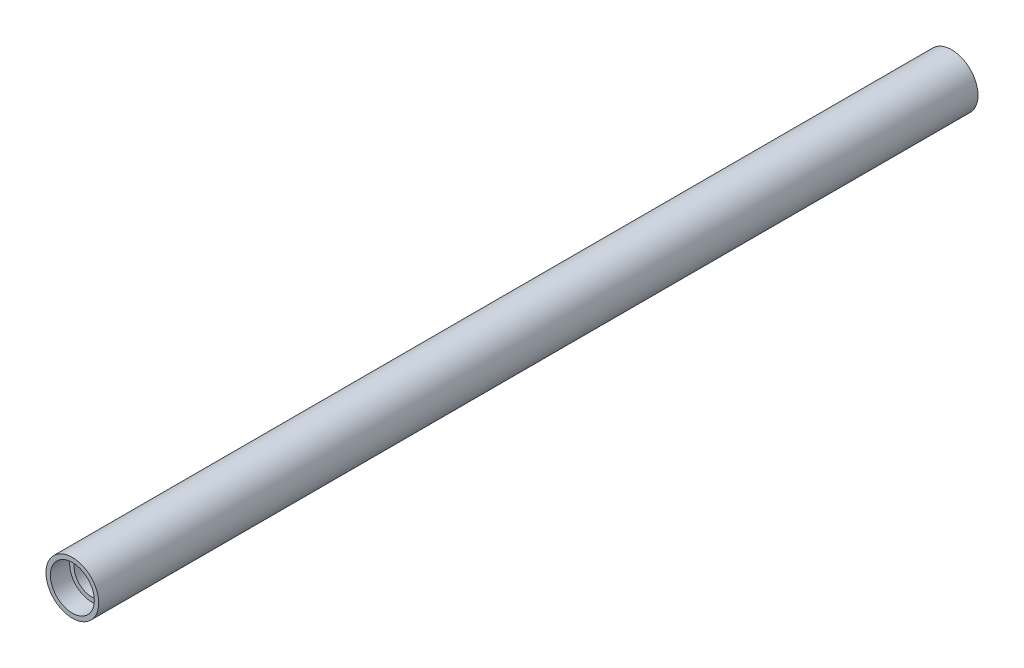
ISO-10303-21;
HEADER;
FILE_DESCRIPTION(('STEP AP214'),'2;1');
FILE_NAME('part.step','',(''),(''),'','','');
FILE_SCHEMA(('AUTOMOTIVE_DESIGN { 1 0 10303 214 1 1 1 1 }'));
ENDSEC;
DATA;
#1=APPLICATION_CONTEXT('core data for automotive mechanical design processes');
#2=APPLICATION_PROTOCOL_DEFINITION('international standard','automotive_design',2000,#1);
#3=PRODUCT_CONTEXT('',#1,'mechanical');
#4=PRODUCT('Part','Part','',(#3));
#5=PRODUCT_RELATED_PRODUCT_CATEGORY('part','',(#4));
#6=PRODUCT_DEFINITION_FORMATION('','',#4);
#7=PRODUCT_DEFINITION_CONTEXT('part definition',#1,'design');
#8=PRODUCT_DEFINITION('design','',#6,#7);
#9=PRODUCT_DEFINITION_SHAPE('','',#8);
#10=(LENGTH_UNIT() NAMED_UNIT(*) SI_UNIT(.MILLI.,.METRE.));
#11=(NAMED_UNIT(*) PLANE_ANGLE_UNIT() SI_UNIT($,.RADIAN.));
#12=(NAMED_UNIT(*) SI_UNIT($,.STERADIAN.) SOLID_ANGLE_UNIT());
#13=UNCERTAINTY_MEASURE_WITH_UNIT(LENGTH_MEASURE(1.E-05),#10,'distance_accuracy_value','');
#14=(GEOMETRIC_REPRESENTATION_CONTEXT(3) GLOBAL_UNCERTAINTY_ASSIGNED_CONTEXT((#13)) GLOBAL_UNIT_ASSIGNED_CONTEXT((#10,
#11,#12)) REPRESENTATION_CONTEXT('',''));
#15=CARTESIAN_POINT('',(0.,0.,0.));
#16=DIRECTION('',(0.,0.,1.));
#17=DIRECTION('',(1.,0.,0.));
#18=AXIS2_PLACEMENT_3D('',#15,#16,#17);
#19=CARTESIAN_POINT('',(0.,0.,125.));
#20=DIRECTION('',(0.,0.,-1.));
#21=DIRECTION('',(-1.,0.,0.));
#22=AXIS2_PLACEMENT_3D('',#19,#20,#21);
#23=CYLINDRICAL_SURFACE('',#22,5.);
#24=CARTESIAN_POINT('',(0.,0.,119.5));
#25=DIRECTION('',(0.,0.,1.));
#26=DIRECTION('',(1.,0.,0.));
#27=AXIS2_PLACEMENT_3D('',#24,#25,#26);
#28=CIRCLE('',#27,5.);
#29=CARTESIAN_POINT('',(5.,0.,119.5));
#30=VERTEX_POINT('',#29);
#31=EDGE_CURVE('E44',#30,#30,#28,.T.);
#32=ORIENTED_EDGE('',*,*,#31,.T.);
#33=EDGE_LOOP('',(#32));
#34=FACE_BOUND('',#33,.T.);
#35=CARTESIAN_POINT('',(0.,0.,-119.5));
#36=DIRECTION('',(0.,0.,-1.));
#37=DIRECTION('',(-1.,0.,0.));
#38=AXIS2_PLACEMENT_3D('',#35,#36,#37);
#39=CIRCLE('',#38,5.);
#40=CARTESIAN_POINT('',(-5.,0.,-119.5));
#41=VERTEX_POINT('',#40);
#42=EDGE_CURVE('E35',#41,#41,#39,.T.);
#43=ORIENTED_EDGE('',*,*,#42,.T.);
#44=EDGE_LOOP('',(#43));
#45=FACE_BOUND('',#44,.T.);
#46=ADVANCED_FACE('F31',(#34,#45),#23,.F.);
#47=CARTESIAN_POINT('',(0.,0.,125.));
#48=DIRECTION('',(0.,0.,1.));
#49=DIRECTION('',(1.,0.,0.));
#50=AXIS2_PLACEMENT_3D('',#47,#48,#49);
#51=PLANE('',#50);
#52=CARTESIAN_POINT('',(0.,0.,125.));
#53=DIRECTION('',(0.,0.,1.));
#54=DIRECTION('',(1.,0.,0.));
#55=AXIS2_PLACEMENT_3D('',#52,#53,#54);
#56=CIRCLE('',#55,6.25);
#57=CARTESIAN_POINT('',(6.25,0.,125.));
#58=VERTEX_POINT('',#57);
#59=EDGE_CURVE('E47',#58,#58,#56,.T.);
#60=ORIENTED_EDGE('',*,*,#59,.F.);
#61=EDGE_LOOP('',(#60));
#62=FACE_BOUND('',#61,.T.);
#63=CARTESIAN_POINT('',(0.,0.,125.));
#64=DIRECTION('',(0.,0.,1.));
#65=DIRECTION('',(1.,0.,0.));
#66=AXIS2_PLACEMENT_3D('',#63,#64,#65);
#67=CIRCLE('',#66,7.5);
#68=CARTESIAN_POINT('',(7.5,0.,125.));
#69=VERTEX_POINT('',#68);
#70=EDGE_CURVE('E10',#69,#69,#67,.T.);
#71=ORIENTED_EDGE('',*,*,#70,.T.);
#72=EDGE_LOOP('',(#71));
#73=FACE_BOUND('',#72,.T.);
#74=ADVANCED_FACE('F80',(#62,#73),#51,.T.);
#75=CARTESIAN_POINT('',(0.,0.,-125.));
#76=DIRECTION('',(0.,0.,1.));
#77=DIRECTION('',(1.,0.,0.));
#78=AXIS2_PLACEMENT_3D('',#75,#76,#77);
#79=PLANE('',#78);
#80=CARTESIAN_POINT('',(0.,0.,-125.));
#81=DIRECTION('',(0.,0.,1.));
#82=DIRECTION('',(1.,0.,0.));
#83=AXIS2_PLACEMENT_3D('',#80,#81,#82);
#84=CIRCLE('',#83,6.25);
#85=CARTESIAN_POINT('',(6.25,0.,-125.));
#86=VERTEX_POINT('',#85);
#87=EDGE_CURVE('E58',#86,#86,#84,.T.);
#88=ORIENTED_EDGE('',*,*,#87,.T.);
#89=EDGE_LOOP('',(#88));
#90=FACE_BOUND('',#89,.T.);
#91=CARTESIAN_POINT('',(0.,0.,-125.));
#92=DIRECTION('',(0.,0.,1.));
#93=DIRECTION('',(1.,0.,0.));
#94=AXIS2_PLACEMENT_3D('',#91,#92,#93);
#95=CIRCLE('',#94,7.5);
#96=CARTESIAN_POINT('',(7.5,0.,-125.));
#97=VERTEX_POINT('',#96);
#98=EDGE_CURVE('E39',#97,#97,#95,.T.);
#99=ORIENTED_EDGE('',*,*,#98,.F.);
#100=EDGE_LOOP('',(#99));
#101=FACE_BOUND('',#100,.T.);
#102=ADVANCED_FACE('F85',(#90,#101),#79,.F.);
#103=CARTESIAN_POINT('',(0.,0.,125.));
#104=DIRECTION('',(0.,0.,-1.));
#105=DIRECTION('',(-1.,0.,0.));
#106=AXIS2_PLACEMENT_3D('',#103,#104,#105);
#107=CYLINDRICAL_SURFACE('',#106,7.5);
#108=ORIENTED_EDGE('',*,*,#70,.F.);
#109=EDGE_LOOP('',(#108));
#110=FACE_BOUND('',#109,.T.);
#111=ORIENTED_EDGE('',*,*,#98,.T.);
#112=EDGE_LOOP('',(#111));
#113=FACE_BOUND('',#112,.T.);
#114=ADVANCED_FACE('F33',(#110,#113),#107,.T.);
#115=CARTESIAN_POINT('',(0.,0.,119.5));
#116=DIRECTION('',(0.,0.,1.));
#117=DIRECTION('',(1.,0.,0.));
#118=AXIS2_PLACEMENT_3D('',#115,#116,#117);
#119=CYLINDRICAL_SURFACE('',#118,6.25);
#120=CARTESIAN_POINT('',(0.,0.,119.5));
#121=DIRECTION('',(0.,0.,1.));
#122=DIRECTION('',(1.,0.,0.));
#123=AXIS2_PLACEMENT_3D('',#120,#121,#122);
#124=CIRCLE('',#123,6.25);
#125=CARTESIAN_POINT('',(6.25,0.,119.5));
#126=VERTEX_POINT('',#125);
#127=EDGE_CURVE('E50',#126,#126,#124,.T.);
#128=ORIENTED_EDGE('',*,*,#127,.F.);
#129=EDGE_LOOP('',(#128));
#130=FACE_BOUND('',#129,.T.);
#131=ORIENTED_EDGE('',*,*,#59,.T.);
#132=EDGE_LOOP('',(#131));
#133=FACE_BOUND('',#132,.T.);
#134=ADVANCED_FACE('F89',(#130,#133),#119,.F.);
#135=CARTESIAN_POINT('',(0.,0.,119.5));
#136=DIRECTION('',(0.,0.,1.));
#137=DIRECTION('',(1.,0.,0.));
#138=AXIS2_PLACEMENT_3D('',#135,#136,#137);
#139=PLANE('',#138);
#140=ORIENTED_EDGE('',*,*,#31,.F.);
#141=EDGE_LOOP('',(#140));
#142=FACE_BOUND('',#141,.T.);
#143=ORIENTED_EDGE('',*,*,#127,.T.);
#144=EDGE_LOOP('',(#143));
#145=FACE_BOUND('',#144,.T.);
#146=ADVANCED_FACE('F77',(#142,#145),#139,.T.);
#147=CARTESIAN_POINT('',(0.,0.,-119.5));
#148=DIRECTION('',(0.,0.,-1.));
#149=DIRECTION('',(-1.,0.,0.));
#150=AXIS2_PLACEMENT_3D('',#147,#148,#149);
#151=CYLINDRICAL_SURFACE('',#150,6.25);
#152=CARTESIAN_POINT('',(0.,0.,-119.5));
#153=DIRECTION('',(0.,0.,1.));
#154=DIRECTION('',(1.,0.,0.));
#155=AXIS2_PLACEMENT_3D('',#152,#153,#154);
#156=CIRCLE('',#155,6.25);
#157=CARTESIAN_POINT('',(6.25,0.,-119.5));
#158=VERTEX_POINT('',#157);
#159=EDGE_CURVE('E61',#158,#158,#156,.T.);
#160=ORIENTED_EDGE('',*,*,#159,.T.);
#161=EDGE_LOOP('',(#160));
#162=FACE_BOUND('',#161,.T.);
#163=ORIENTED_EDGE('',*,*,#87,.F.);
#164=EDGE_LOOP('',(#163));
#165=FACE_BOUND('',#164,.T.);
#166=ADVANCED_FACE('F72',(#162,#165),#151,.F.);
#167=CARTESIAN_POINT('',(0.,0.,-119.5));
#168=DIRECTION('',(0.,0.,-1.));
#169=DIRECTION('',(1.,0.,0.));
#170=AXIS2_PLACEMENT_3D('',#167,#168,#169);
#171=PLANE('',#170);
#172=ORIENTED_EDGE('',*,*,#42,.F.);
#173=EDGE_LOOP('',(#172));
#174=FACE_BOUND('',#173,.T.);
#175=ORIENTED_EDGE('',*,*,#159,.F.);
#176=EDGE_LOOP('',(#175));
#177=FACE_BOUND('',#176,.T.);
#178=ADVANCED_FACE('F69',(#174,#177),#171,.T.);
#179=CLOSED_SHELL('',(#46,#74,#102,#114,#134,#146,#166,#178));
#180=MANIFOLD_SOLID_BREP('B2',#179);
#181=ADVANCED_BREP_SHAPE_REPRESENTATION('',(#18,#180),#14);
#182=SHAPE_DEFINITION_REPRESENTATION(#9,#181);
ENDSEC;
END-ISO-10303-21;
